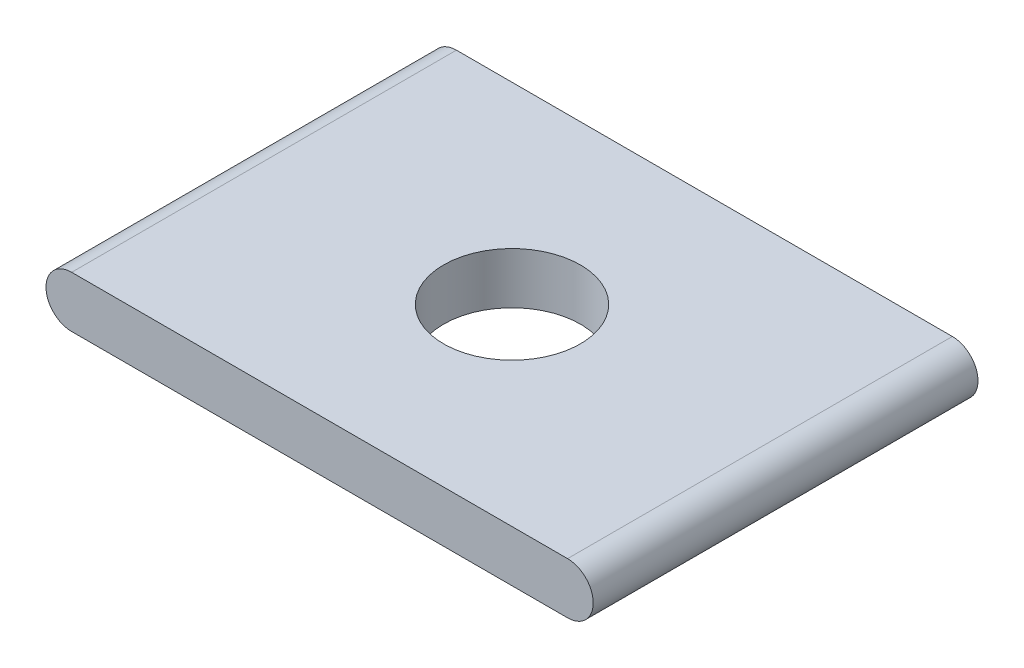
ISO-10303-21;
HEADER;
FILE_DESCRIPTION(('STEP AP214'),'2;1');
FILE_NAME('part.step','',(''),(''),'','','');
FILE_SCHEMA(('AUTOMOTIVE_DESIGN { 1 0 10303 214 1 1 1 1 }'));
ENDSEC;
DATA;
#1=APPLICATION_CONTEXT('core data for automotive mechanical design processes');
#2=APPLICATION_PROTOCOL_DEFINITION('international standard','automotive_design',2000,#1);
#3=PRODUCT_CONTEXT('',#1,'mechanical');
#4=PRODUCT('Part','Part','',(#3));
#5=PRODUCT_RELATED_PRODUCT_CATEGORY('part','',(#4));
#6=PRODUCT_DEFINITION_FORMATION('','',#4);
#7=PRODUCT_DEFINITION_CONTEXT('part definition',#1,'design');
#8=PRODUCT_DEFINITION('design','',#6,#7);
#9=PRODUCT_DEFINITION_SHAPE('','',#8);
#10=(LENGTH_UNIT() NAMED_UNIT(*) SI_UNIT(.MILLI.,.METRE.));
#11=(NAMED_UNIT(*) PLANE_ANGLE_UNIT() SI_UNIT($,.RADIAN.));
#12=(NAMED_UNIT(*) SI_UNIT($,.STERADIAN.) SOLID_ANGLE_UNIT());
#13=UNCERTAINTY_MEASURE_WITH_UNIT(LENGTH_MEASURE(1.E-05),#10,'distance_accuracy_value','');
#14=(GEOMETRIC_REPRESENTATION_CONTEXT(3) GLOBAL_UNCERTAINTY_ASSIGNED_CONTEXT((#13)) GLOBAL_UNIT_ASSIGNED_CONTEXT((#10,
#11,#12)) REPRESENTATION_CONTEXT('',''));
#15=CARTESIAN_POINT('',(0.,0.,0.));
#16=DIRECTION('',(0.,0.,1.));
#17=DIRECTION('',(1.,0.,0.));
#18=AXIS2_PLACEMENT_3D('',#15,#16,#17);
#19=CARTESIAN_POINT('',(-18.415,0.,28.575));
#20=DIRECTION('',(0.,0.,-1.));
#21=DIRECTION('',(-1.,0.,0.));
#22=AXIS2_PLACEMENT_3D('',#19,#20,#21);
#23=CYLINDRICAL_SURFACE('',#22,1.905);
#24=CARTESIAN_POINT('',(-18.415,0.,0.));
#25=DIRECTION('',(0.,0.,1.));
#26=DIRECTION('',(-1.,0.,0.));
#27=AXIS2_PLACEMENT_3D('',#24,#25,#26);
#28=CIRCLE('',#27,1.905);
#29=CARTESIAN_POINT('',(-18.415,1.905,0.));
#30=VERTEX_POINT('',#29);
#31=CARTESIAN_POINT('',(-18.415,-1.905,0.));
#32=VERTEX_POINT('',#31);
#33=EDGE_CURVE('E95',#30,#32,#28,.T.);
#34=ORIENTED_EDGE('',*,*,#33,.T.);
#35=DIRECTION('',(0.,0.,-1.));
#36=VECTOR('',#35,1.);
#37=CARTESIAN_POINT('',(-18.415,-1.905,28.575));
#38=LINE('',#37,#36);
#39=CARTESIAN_POINT('',(-18.415,-1.905,28.575));
#40=VERTEX_POINT('',#39);
#41=EDGE_CURVE('E11',#40,#32,#38,.T.);
#42=ORIENTED_EDGE('',*,*,#41,.F.);
#43=CARTESIAN_POINT('',(-18.415,0.,28.575));
#44=DIRECTION('',(0.,0.,1.));
#45=DIRECTION('',(-1.,0.,0.));
#46=AXIS2_PLACEMENT_3D('',#43,#44,#45);
#47=CIRCLE('',#46,1.905);
#48=CARTESIAN_POINT('',(-18.415,1.905,28.575));
#49=VERTEX_POINT('',#48);
#50=EDGE_CURVE('E83',#49,#40,#47,.T.);
#51=ORIENTED_EDGE('',*,*,#50,.F.);
#52=DIRECTION('',(0.,0.,-1.));
#53=VECTOR('',#52,1.);
#54=CARTESIAN_POINT('',(-18.415,1.905,28.575));
#55=LINE('',#54,#53);
#56=EDGE_CURVE('E91',#49,#30,#55,.T.);
#57=ORIENTED_EDGE('',*,*,#56,.T.);
#58=EDGE_LOOP('',(#34,#42,#51,#57));
#59=FACE_BOUND('',#58,.T.);
#60=ADVANCED_FACE('F32',(#59),#23,.T.);
#61=CARTESIAN_POINT('',(18.415,-1.905,28.575));
#62=DIRECTION('',(0.,1.,0.));
#63=DIRECTION('',(0.,0.,1.));
#64=AXIS2_PLACEMENT_3D('',#61,#62,#63);
#65=PLANE('',#64);
#66=CARTESIAN_POINT('',(0.,-1.905,14.2875));
#67=DIRECTION('',(0.,1.,0.));
#68=DIRECTION('',(-1.,0.,0.));
#69=AXIS2_PLACEMENT_3D('',#66,#67,#68);
#70=CIRCLE('',#69,5.08);
#71=CARTESIAN_POINT('',(-5.08,-1.905,14.2875));
#72=VERTEX_POINT('',#71);
#73=EDGE_CURVE('E98',#72,#72,#70,.T.);
#74=ORIENTED_EDGE('',*,*,#73,.T.);
#75=EDGE_LOOP('',(#74));
#76=FACE_BOUND('',#75,.T.);
#77=DIRECTION('',(1.,0.,0.));
#78=VECTOR('',#77,1.);
#79=CARTESIAN_POINT('',(18.415,-1.905,0.));
#80=LINE('',#79,#78);
#81=CARTESIAN_POINT('',(18.415,-1.905,0.));
#82=VERTEX_POINT('',#81);
#83=EDGE_CURVE('E87',#32,#82,#80,.T.);
#84=ORIENTED_EDGE('',*,*,#83,.T.);
#85=DIRECTION('',(0.,0.,-1.));
#86=VECTOR('',#85,1.);
#87=CARTESIAN_POINT('',(18.415,-1.905,28.575));
#88=LINE('',#87,#86);
#89=CARTESIAN_POINT('',(18.415,-1.905,28.575));
#90=VERTEX_POINT('',#89);
#91=EDGE_CURVE('E40',#90,#82,#88,.T.);
#92=ORIENTED_EDGE('',*,*,#91,.F.);
#93=DIRECTION('',(1.,0.,0.));
#94=VECTOR('',#93,1.);
#95=CARTESIAN_POINT('',(18.415,-1.905,28.575));
#96=LINE('',#95,#94);
#97=EDGE_CURVE('E78',#40,#90,#96,.T.);
#98=ORIENTED_EDGE('',*,*,#97,.F.);
#99=ORIENTED_EDGE('',*,*,#41,.T.);
#100=EDGE_LOOP('',(#84,#92,#98,#99));
#101=FACE_BOUND('',#100,.T.);
#102=ADVANCED_FACE('F86',(#76,#101),#65,.F.);
#103=CARTESIAN_POINT('',(18.415,0.,28.575));
#104=DIRECTION('',(0.,0.,-1.));
#105=DIRECTION('',(-1.,0.,0.));
#106=AXIS2_PLACEMENT_3D('',#103,#104,#105);
#107=CYLINDRICAL_SURFACE('',#106,1.905);
#108=CARTESIAN_POINT('',(18.415,0.,0.));
#109=DIRECTION('',(0.,0.,1.));
#110=DIRECTION('',(-1.,0.,0.));
#111=AXIS2_PLACEMENT_3D('',#108,#109,#110);
#112=CIRCLE('',#111,1.905);
#113=CARTESIAN_POINT('',(18.415,1.905,0.));
#114=VERTEX_POINT('',#113);
#115=EDGE_CURVE('E65',#82,#114,#112,.T.);
#116=ORIENTED_EDGE('',*,*,#115,.T.);
#117=DIRECTION('',(0.,0.,-1.));
#118=VECTOR('',#117,1.);
#119=CARTESIAN_POINT('',(18.415,1.905,28.575));
#120=LINE('',#119,#118);
#121=CARTESIAN_POINT('',(18.415,1.905,28.575));
#122=VERTEX_POINT('',#121);
#123=EDGE_CURVE('E88',#122,#114,#120,.T.);
#124=ORIENTED_EDGE('',*,*,#123,.F.);
#125=CARTESIAN_POINT('',(18.415,0.,28.575));
#126=DIRECTION('',(0.,0.,1.));
#127=DIRECTION('',(-1.,0.,0.));
#128=AXIS2_PLACEMENT_3D('',#125,#126,#127);
#129=CIRCLE('',#128,1.905);
#130=EDGE_CURVE('E81',#90,#122,#129,.T.);
#131=ORIENTED_EDGE('',*,*,#130,.F.);
#132=ORIENTED_EDGE('',*,*,#91,.T.);
#133=EDGE_LOOP('',(#116,#124,#131,#132));
#134=FACE_BOUND('',#133,.T.);
#135=ADVANCED_FACE('F89',(#134),#107,.T.);
#136=CARTESIAN_POINT('',(-18.415,1.905,28.575));
#137=DIRECTION('',(0.,-1.,0.));
#138=DIRECTION('',(1.,0.,0.));
#139=AXIS2_PLACEMENT_3D('',#136,#137,#138);
#140=PLANE('',#139);
#141=CARTESIAN_POINT('',(0.,1.905,14.2875));
#142=DIRECTION('',(0.,1.,0.));
#143=DIRECTION('',(-1.,0.,0.));
#144=AXIS2_PLACEMENT_3D('',#141,#142,#143);
#145=CIRCLE('',#144,5.08);
#146=CARTESIAN_POINT('',(-5.08,1.905,14.2875));
#147=VERTEX_POINT('',#146);
#148=EDGE_CURVE('E109',#147,#147,#145,.T.);
#149=ORIENTED_EDGE('',*,*,#148,.F.);
#150=EDGE_LOOP('',(#149));
#151=FACE_BOUND('',#150,.T.);
#152=DIRECTION('',(-1.,0.,0.));
#153=VECTOR('',#152,1.);
#154=CARTESIAN_POINT('',(-18.415,1.905,0.));
#155=LINE('',#154,#153);
#156=EDGE_CURVE('E71',#114,#30,#155,.T.);
#157=ORIENTED_EDGE('',*,*,#156,.T.);
#158=ORIENTED_EDGE('',*,*,#56,.F.);
#159=DIRECTION('',(-1.,0.,0.));
#160=VECTOR('',#159,1.);
#161=CARTESIAN_POINT('',(-18.415,1.905,28.575));
#162=LINE('',#161,#160);
#163=EDGE_CURVE('E48',#122,#49,#162,.T.);
#164=ORIENTED_EDGE('',*,*,#163,.F.);
#165=ORIENTED_EDGE('',*,*,#123,.T.);
#166=EDGE_LOOP('',(#157,#158,#164,#165));
#167=FACE_BOUND('',#166,.T.);
#168=ADVANCED_FACE('F103',(#151,#167),#140,.F.);
#169=CARTESIAN_POINT('',(-18.415,0.,28.575));
#170=DIRECTION('',(0.,0.,-1.));
#171=DIRECTION('',(-1.,0.,0.));
#172=AXIS2_PLACEMENT_3D('',#169,#170,#171);
#173=PLANE('',#172);
#174=ORIENTED_EDGE('',*,*,#50,.T.);
#175=ORIENTED_EDGE('',*,*,#97,.T.);
#176=ORIENTED_EDGE('',*,*,#130,.T.);
#177=ORIENTED_EDGE('',*,*,#163,.T.);
#178=EDGE_LOOP('',(#174,#175,#176,#177));
#179=FACE_BOUND('',#178,.T.);
#180=ADVANCED_FACE('F79',(#179),#173,.F.);
#181=CARTESIAN_POINT('',(-18.415,0.,0.));
#182=DIRECTION('',(0.,0.,-1.));
#183=DIRECTION('',(-1.,0.,0.));
#184=AXIS2_PLACEMENT_3D('',#181,#182,#183);
#185=PLANE('',#184);
#186=ORIENTED_EDGE('',*,*,#33,.F.);
#187=ORIENTED_EDGE('',*,*,#156,.F.);
#188=ORIENTED_EDGE('',*,*,#115,.F.);
#189=ORIENTED_EDGE('',*,*,#83,.F.);
#190=EDGE_LOOP('',(#186,#187,#188,#189));
#191=FACE_BOUND('',#190,.T.);
#192=ADVANCED_FACE('F106',(#191),#185,.T.);
#193=CARTESIAN_POINT('',(0.,-1.905,14.2875));
#194=DIRECTION('',(0.,1.,0.));
#195=DIRECTION('',(-1.,0.,0.));
#196=AXIS2_PLACEMENT_3D('',#193,#194,#195);
#197=CYLINDRICAL_SURFACE('',#196,5.08);
#198=ORIENTED_EDGE('',*,*,#73,.F.);
#199=EDGE_LOOP('',(#198));
#200=FACE_BOUND('',#199,.T.);
#201=ORIENTED_EDGE('',*,*,#148,.T.);
#202=EDGE_LOOP('',(#201));
#203=FACE_BOUND('',#202,.T.);
#204=ADVANCED_FACE('F116',(#200,#203),#197,.F.);
#205=CLOSED_SHELL('',(#60,#102,#135,#168,#180,#192,#204));
#206=MANIFOLD_SOLID_BREP('B2',#205);
#207=ADVANCED_BREP_SHAPE_REPRESENTATION('',(#18,#206),#14);
#208=SHAPE_DEFINITION_REPRESENTATION(#9,#207);
ENDSEC;
END-ISO-10303-21;
